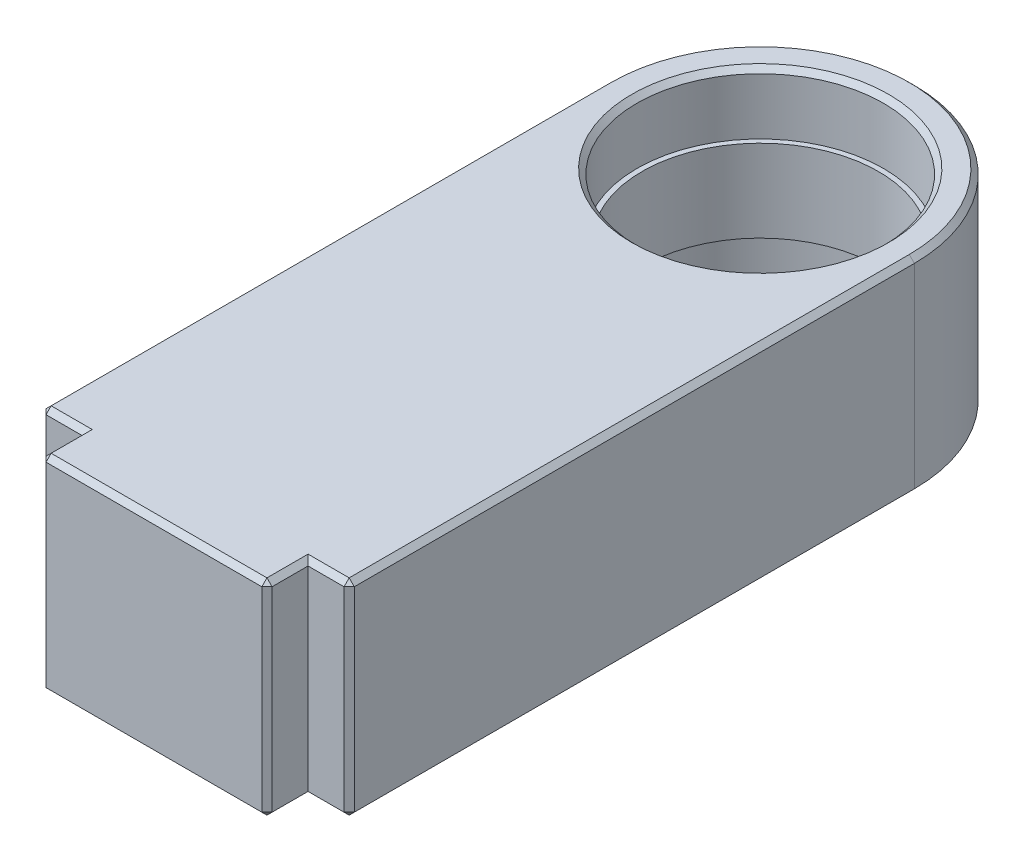
ISO-10303-21;
HEADER;
FILE_DESCRIPTION(('STEP AP214'),'2;1');
FILE_NAME('part.step','',(''),(''),'','','');
FILE_SCHEMA(('AUTOMOTIVE_DESIGN { 1 0 10303 214 1 1 1 1 }'));
ENDSEC;
DATA;
#1=APPLICATION_CONTEXT('core data for automotive mechanical design processes');
#2=APPLICATION_PROTOCOL_DEFINITION('international standard','automotive_design',2000,#1);
#3=PRODUCT_CONTEXT('',#1,'mechanical');
#4=PRODUCT('Part','Part','',(#3));
#5=PRODUCT_RELATED_PRODUCT_CATEGORY('part','',(#4));
#6=PRODUCT_DEFINITION_FORMATION('','',#4);
#7=PRODUCT_DEFINITION_CONTEXT('part definition',#1,'design');
#8=PRODUCT_DEFINITION('design','',#6,#7);
#9=PRODUCT_DEFINITION_SHAPE('','',#8);
#10=(LENGTH_UNIT() NAMED_UNIT(*) SI_UNIT(.MILLI.,.METRE.));
#11=(NAMED_UNIT(*) PLANE_ANGLE_UNIT() SI_UNIT($,.RADIAN.));
#12=(NAMED_UNIT(*) SI_UNIT($,.STERADIAN.) SOLID_ANGLE_UNIT());
#13=UNCERTAINTY_MEASURE_WITH_UNIT(LENGTH_MEASURE(1.E-05),#10,'distance_accuracy_value','');
#14=(GEOMETRIC_REPRESENTATION_CONTEXT(3) GLOBAL_UNCERTAINTY_ASSIGNED_CONTEXT((#13)) GLOBAL_UNIT_ASSIGNED_CONTEXT((#10,
#11,#12)) REPRESENTATION_CONTEXT('',''));
#15=CARTESIAN_POINT('',(0.,0.,0.));
#16=DIRECTION('',(0.,0.,1.));
#17=DIRECTION('',(1.,0.,0.));
#18=AXIS2_PLACEMENT_3D('',#15,#16,#17);
#19=CARTESIAN_POINT('',(15.,10.,55.));
#20=DIRECTION('',(0.,0.,-1.));
#21=DIRECTION('',(-1.,0.,0.));
#22=AXIS2_PLACEMENT_3D('',#19,#20,#21);
#23=PLANE('',#22);
#24=DIRECTION('',(0.,-1.,0.));
#25=VECTOR('',#24,1.);
#26=CARTESIAN_POINT('',(-11.,-10.,55.));
#27=LINE('',#26,#25);
#28=CARTESIAN_POINT('',(-11.,9.50000000000001,55.));
#29=VERTEX_POINT('',#28);
#30=CARTESIAN_POINT('',(-11.,-9.50000000000001,55.));
#31=VERTEX_POINT('',#30);
#32=EDGE_CURVE('E362',#29,#31,#27,.T.);
#33=ORIENTED_EDGE('',*,*,#32,.F.);
#34=DIRECTION('',(-1.,0.,0.));
#35=VECTOR('',#34,1.);
#36=CARTESIAN_POINT('',(-15.,9.50000000000001,55.));
#37=LINE('',#36,#35);
#38=CARTESIAN_POINT('',(-14.5,9.50000000000001,55.));
#39=VERTEX_POINT('',#38);
#40=EDGE_CURVE('E266',#29,#39,#37,.T.);
#41=ORIENTED_EDGE('',*,*,#40,.T.);
#42=DIRECTION('',(0.,-1.,0.));
#43=VECTOR('',#42,1.);
#44=CARTESIAN_POINT('',(-14.5,10.,55.));
#45=LINE('',#44,#43);
#46=CARTESIAN_POINT('',(-14.5,-9.50000000000001,55.));
#47=VERTEX_POINT('',#46);
#48=EDGE_CURVE('E264',#39,#47,#45,.T.);
#49=ORIENTED_EDGE('',*,*,#48,.T.);
#50=DIRECTION('',(1.,0.,0.));
#51=VECTOR('',#50,1.);
#52=CARTESIAN_POINT('',(15.,-9.50000000000001,55.));
#53=LINE('',#52,#51);
#54=EDGE_CURVE('E262',#47,#31,#53,.T.);
#55=ORIENTED_EDGE('',*,*,#54,.T.);
#56=EDGE_LOOP('',(#33,#41,#49,#55));
#57=FACE_BOUND('',#56,.T.);
#58=ADVANCED_FACE('F33',(#57),#23,.F.);
#59=DIRECTION('',(0.,1.,0.));
#60=VECTOR('',#59,1.);
#61=CARTESIAN_POINT('',(14.5,10.,55.));
#62=LINE('',#61,#60);
#63=CARTESIAN_POINT('',(14.5,-9.50000000000001,55.));
#64=VERTEX_POINT('',#63);
#65=CARTESIAN_POINT('',(14.5,9.50000000000001,55.));
#66=VERTEX_POINT('',#65);
#67=EDGE_CURVE('E237',#64,#66,#62,.T.);
#68=ORIENTED_EDGE('',*,*,#67,.T.);
#69=DIRECTION('',(-1.,0.,0.));
#70=VECTOR('',#69,1.);
#71=CARTESIAN_POINT('',(11.,9.50000000000001,55.));
#72=LINE('',#71,#70);
#73=CARTESIAN_POINT('',(11.,9.50000000000001,55.));
#74=VERTEX_POINT('',#73);
#75=EDGE_CURVE('E176',#66,#74,#72,.T.);
#76=ORIENTED_EDGE('',*,*,#75,.T.);
#77=DIRECTION('',(0.,1.,0.));
#78=VECTOR('',#77,1.);
#79=CARTESIAN_POINT('',(11.,-10.,55.));
#80=LINE('',#79,#78);
#81=CARTESIAN_POINT('',(11.,-9.50000000000001,55.));
#82=VERTEX_POINT('',#81);
#83=EDGE_CURVE('E368',#82,#74,#80,.T.);
#84=ORIENTED_EDGE('',*,*,#83,.F.);
#85=DIRECTION('',(1.,0.,0.));
#86=VECTOR('',#85,1.);
#87=CARTESIAN_POINT('',(15.,-9.50000000000001,55.));
#88=LINE('',#87,#86);
#89=EDGE_CURVE('E235',#82,#64,#88,.T.);
#90=ORIENTED_EDGE('',*,*,#89,.T.);
#91=EDGE_LOOP('',(#68,#76,#84,#90));
#92=FACE_BOUND('',#91,.T.);
#93=ADVANCED_FACE('F419',(#92),#23,.F.);
#94=CARTESIAN_POINT('',(0.,10.,0.));
#95=DIRECTION('',(0.,-1.,0.));
#96=DIRECTION('',(0.,0.,-1.));
#97=AXIS2_PLACEMENT_3D('',#94,#95,#96);
#98=CYLINDRICAL_SURFACE('',#97,12.);
#99=CARTESIAN_POINT('',(0.,-9.50000000000001,0.));
#100=DIRECTION('',(0.,1.,0.));
#101=DIRECTION('',(0.,0.,1.));
#102=AXIS2_PLACEMENT_3D('',#99,#100,#101);
#103=CIRCLE('',#102,12.);
#104=CARTESIAN_POINT('',(0.,-9.50000000000001,12.));
#105=VERTEX_POINT('',#104);
#106=EDGE_CURVE('E232',#105,#105,#103,.F.);
#107=ORIENTED_EDGE('',*,*,#106,.T.);
#108=EDGE_LOOP('',(#107));
#109=FACE_BOUND('',#108,.T.);
#110=CARTESIAN_POINT('',(0.,-4.,0.));
#111=DIRECTION('',(0.,1.,0.));
#112=DIRECTION('',(0.,0.,1.));
#113=AXIS2_PLACEMENT_3D('',#110,#111,#112);
#114=CIRCLE('',#113,12.);
#115=CARTESIAN_POINT('',(0.,-4.,12.));
#116=VERTEX_POINT('',#115);
#117=EDGE_CURVE('E379',#116,#116,#114,.T.);
#118=ORIENTED_EDGE('',*,*,#117,.T.);
#119=EDGE_LOOP('',(#118));
#120=FACE_BOUND('',#119,.T.);
#121=ADVANCED_FACE('F497',(#109,#120),#98,.F.);
#122=CARTESIAN_POINT('',(0.,10.,0.));
#123=DIRECTION('',(0.,1.,0.));
#124=DIRECTION('',(0.,0.,1.));
#125=AXIS2_PLACEMENT_3D('',#122,#123,#124);
#126=PLANE('',#125);
#127=CARTESIAN_POINT('',(0.,10.,0.));
#128=DIRECTION('',(0.,1.,0.));
#129=DIRECTION('',(0.,0.,1.));
#130=AXIS2_PLACEMENT_3D('',#127,#128,#129);
#131=CIRCLE('',#130,12.5);
#132=CARTESIAN_POINT('',(0.,10.,12.5));
#133=VERTEX_POINT('',#132);
#134=EDGE_CURVE('E204',#133,#133,#131,.F.);
#135=ORIENTED_EDGE('',*,*,#134,.T.);
#136=EDGE_LOOP('',(#135));
#137=FACE_BOUND('',#136,.T.);
#138=DIRECTION('',(0.,0.,-1.));
#139=VECTOR('',#138,1.);
#140=CARTESIAN_POINT('',(10.5,10.,55.));
#141=LINE('',#140,#139);
#142=CARTESIAN_POINT('',(10.5,10.,58.5));
#143=VERTEX_POINT('',#142);
#144=CARTESIAN_POINT('',(10.5,10.,54.5));
#145=VERTEX_POINT('',#144);
#146=EDGE_CURVE('E202',#143,#145,#141,.T.);
#147=ORIENTED_EDGE('',*,*,#146,.T.);
#148=DIRECTION('',(1.,0.,0.));
#149=VECTOR('',#148,1.);
#150=CARTESIAN_POINT('',(15.,10.,54.5));
#151=LINE('',#150,#149);
#152=CARTESIAN_POINT('',(14.5,10.,54.5));
#153=VERTEX_POINT('',#152);
#154=EDGE_CURVE('E174',#145,#153,#151,.T.);
#155=ORIENTED_EDGE('',*,*,#154,.T.);
#156=DIRECTION('',(0.,0.,-1.));
#157=VECTOR('',#156,1.);
#158=CARTESIAN_POINT('',(14.5,10.,0.));
#159=LINE('',#158,#157);
#160=CARTESIAN_POINT('',(14.5,10.,0.));
#161=VERTEX_POINT('',#160);
#162=EDGE_CURVE('E191',#153,#161,#159,.T.);
#163=ORIENTED_EDGE('',*,*,#162,.T.);
#164=CARTESIAN_POINT('',(0.,10.,0.));
#165=DIRECTION('',(0.,1.,0.));
#166=DIRECTION('',(0.,0.,1.));
#167=AXIS2_PLACEMENT_3D('',#164,#165,#166);
#168=CIRCLE('',#167,14.5);
#169=CARTESIAN_POINT('',(-14.5,10.,0.));
#170=VERTEX_POINT('',#169);
#171=EDGE_CURVE('E197',#161,#170,#168,.T.);
#172=ORIENTED_EDGE('',*,*,#171,.T.);
#173=DIRECTION('',(0.,0.,1.));
#174=VECTOR('',#173,1.);
#175=CARTESIAN_POINT('',(-14.5,10.,55.));
#176=LINE('',#175,#174);
#177=CARTESIAN_POINT('',(-14.5,10.,54.5));
#178=VERTEX_POINT('',#177);
#179=EDGE_CURVE('E396',#170,#178,#176,.T.);
#180=ORIENTED_EDGE('',*,*,#179,.T.);
#181=DIRECTION('',(1.,0.,0.));
#182=VECTOR('',#181,1.);
#183=CARTESIAN_POINT('',(-11.,10.,54.5));
#184=LINE('',#183,#182);
#185=CARTESIAN_POINT('',(-10.5,10.,54.5));
#186=VERTEX_POINT('',#185);
#187=EDGE_CURVE('E398',#178,#186,#184,.T.);
#188=ORIENTED_EDGE('',*,*,#187,.T.);
#189=DIRECTION('',(0.,0.,1.));
#190=VECTOR('',#189,1.);
#191=CARTESIAN_POINT('',(-10.5,10.,59.));
#192=LINE('',#191,#190);
#193=CARTESIAN_POINT('',(-10.5,10.,58.5));
#194=VERTEX_POINT('',#193);
#195=EDGE_CURVE('E400',#186,#194,#192,.T.);
#196=ORIENTED_EDGE('',*,*,#195,.T.);
#197=DIRECTION('',(1.,0.,0.));
#198=VECTOR('',#197,1.);
#199=CARTESIAN_POINT('',(0.,10.,58.5));
#200=LINE('',#199,#198);
#201=EDGE_CURVE('E209',#194,#143,#200,.T.);
#202=ORIENTED_EDGE('',*,*,#201,.T.);
#203=EDGE_LOOP('',(#147,#155,#163,#172,#180,#188,#196,#202));
#204=FACE_BOUND('',#203,.T.);
#205=ADVANCED_FACE('F200',(#137,#204),#126,.T.);
#206=CARTESIAN_POINT('',(0.,-10.,0.));
#207=DIRECTION('',(0.,1.,0.));
#208=DIRECTION('',(0.,0.,1.));
#209=AXIS2_PLACEMENT_3D('',#206,#207,#208);
#210=PLANE('',#209);
#211=CARTESIAN_POINT('',(0.,-10.,0.));
#212=DIRECTION('',(0.,1.,0.));
#213=DIRECTION('',(0.,0.,1.));
#214=AXIS2_PLACEMENT_3D('',#211,#212,#213);
#215=CIRCLE('',#214,12.5);
#216=CARTESIAN_POINT('',(0.,-10.,12.5));
#217=VERTEX_POINT('',#216);
#218=EDGE_CURVE('E229',#217,#217,#215,.T.);
#219=ORIENTED_EDGE('',*,*,#218,.T.);
#220=EDGE_LOOP('',(#219));
#221=FACE_BOUND('',#220,.T.);
#222=DIRECTION('',(0.,0.,-1.));
#223=VECTOR('',#222,1.);
#224=CARTESIAN_POINT('',(-14.5,-10.,0.));
#225=LINE('',#224,#223);
#226=CARTESIAN_POINT('',(-14.5,-10.,54.5));
#227=VERTEX_POINT('',#226);
#228=CARTESIAN_POINT('',(-14.5,-10.,0.));
#229=VERTEX_POINT('',#228);
#230=EDGE_CURVE('E224',#227,#229,#225,.T.);
#231=ORIENTED_EDGE('',*,*,#230,.T.);
#232=CARTESIAN_POINT('',(0.,-10.,0.));
#233=DIRECTION('',(0.,1.,0.));
#234=DIRECTION('',(0.,0.,1.));
#235=AXIS2_PLACEMENT_3D('',#232,#233,#234);
#236=CIRCLE('',#235,14.5);
#237=CARTESIAN_POINT('',(14.5,-10.,0.));
#238=VERTEX_POINT('',#237);
#239=EDGE_CURVE('E226',#229,#238,#236,.F.);
#240=ORIENTED_EDGE('',*,*,#239,.T.);
#241=DIRECTION('',(0.,0.,1.));
#242=VECTOR('',#241,1.);
#243=CARTESIAN_POINT('',(14.5,-10.,0.));
#244=LINE('',#243,#242);
#245=CARTESIAN_POINT('',(14.5,-10.,54.5));
#246=VERTEX_POINT('',#245);
#247=EDGE_CURVE('E218',#238,#246,#244,.T.);
#248=ORIENTED_EDGE('',*,*,#247,.T.);
#249=DIRECTION('',(-1.,0.,0.));
#250=VECTOR('',#249,1.);
#251=CARTESIAN_POINT('',(0.,-10.,54.5));
#252=LINE('',#251,#250);
#253=CARTESIAN_POINT('',(10.5,-10.,54.5));
#254=VERTEX_POINT('',#253);
#255=EDGE_CURVE('E216',#246,#254,#252,.T.);
#256=ORIENTED_EDGE('',*,*,#255,.T.);
#257=DIRECTION('',(0.,0.,1.));
#258=VECTOR('',#257,1.);
#259=CARTESIAN_POINT('',(10.5,-10.,0.));
#260=LINE('',#259,#258);
#261=CARTESIAN_POINT('',(10.5,-10.,58.5));
#262=VERTEX_POINT('',#261);
#263=EDGE_CURVE('E214',#254,#262,#260,.T.);
#264=ORIENTED_EDGE('',*,*,#263,.T.);
#265=DIRECTION('',(-1.,0.,0.));
#266=VECTOR('',#265,1.);
#267=CARTESIAN_POINT('',(-11.,-10.,58.5));
#268=LINE('',#267,#266);
#269=CARTESIAN_POINT('',(-10.5,-10.,58.5));
#270=VERTEX_POINT('',#269);
#271=EDGE_CURVE('E207',#262,#270,#268,.T.);
#272=ORIENTED_EDGE('',*,*,#271,.T.);
#273=DIRECTION('',(0.,0.,-1.));
#274=VECTOR('',#273,1.);
#275=CARTESIAN_POINT('',(-10.5,-10.,0.));
#276=LINE('',#275,#274);
#277=CARTESIAN_POINT('',(-10.5,-10.,54.5));
#278=VERTEX_POINT('',#277);
#279=EDGE_CURVE('E220',#270,#278,#276,.T.);
#280=ORIENTED_EDGE('',*,*,#279,.T.);
#281=DIRECTION('',(-1.,0.,0.));
#282=VECTOR('',#281,1.);
#283=CARTESIAN_POINT('',(0.,-10.,54.5));
#284=LINE('',#283,#282);
#285=EDGE_CURVE('E222',#278,#227,#284,.T.);
#286=ORIENTED_EDGE('',*,*,#285,.T.);
#287=EDGE_LOOP('',(#231,#240,#248,#256,#264,#272,#280,#286));
#288=FACE_BOUND('',#287,.T.);
#289=ADVANCED_FACE('F445',(#221,#288),#210,.F.);
#290=CARTESIAN_POINT('',(15.,10.,55.));
#291=DIRECTION('',(-1.,0.,0.));
#292=DIRECTION('',(0.,0.,1.));
#293=AXIS2_PLACEMENT_3D('',#290,#291,#292);
#294=PLANE('',#293);
#295=DIRECTION('',(0.,-1.,0.));
#296=VECTOR('',#295,1.);
#297=CARTESIAN_POINT('',(15.,10.,0.));
#298=LINE('',#297,#296);
#299=CARTESIAN_POINT('',(15.,9.50000000000001,0.));
#300=VERTEX_POINT('',#299);
#301=CARTESIAN_POINT('',(15.,-9.50000000000001,0.));
#302=VERTEX_POINT('',#301);
#303=EDGE_CURVE('E387',#300,#302,#298,.T.);
#304=ORIENTED_EDGE('',*,*,#303,.F.);
#305=DIRECTION('',(0.,0.,1.));
#306=VECTOR('',#305,1.);
#307=CARTESIAN_POINT('',(15.,9.50000000000001,55.));
#308=LINE('',#307,#306);
#309=CARTESIAN_POINT('',(15.,9.50000000000001,54.5));
#310=VERTEX_POINT('',#309);
#311=EDGE_CURVE('E11',#300,#310,#308,.T.);
#312=ORIENTED_EDGE('',*,*,#311,.T.);
#313=DIRECTION('',(0.,-1.,0.));
#314=VECTOR('',#313,1.);
#315=CARTESIAN_POINT('',(15.,10.,54.5));
#316=LINE('',#315,#314);
#317=CARTESIAN_POINT('',(15.,-9.50000000000001,54.5));
#318=VERTEX_POINT('',#317);
#319=EDGE_CURVE('E49',#310,#318,#316,.T.);
#320=ORIENTED_EDGE('',*,*,#319,.T.);
#321=DIRECTION('',(0.,0.,-1.));
#322=VECTOR('',#321,1.);
#323=CARTESIAN_POINT('',(15.,-9.50000000000001,55.));
#324=LINE('',#323,#322);
#325=EDGE_CURVE('E42',#318,#302,#324,.T.);
#326=ORIENTED_EDGE('',*,*,#325,.T.);
#327=EDGE_LOOP('',(#304,#312,#320,#326));
#328=FACE_BOUND('',#327,.T.);
#329=ADVANCED_FACE('F509',(#328),#294,.F.);
#330=CARTESIAN_POINT('',(0.,10.,0.));
#331=DIRECTION('',(0.,-1.,0.));
#332=DIRECTION('',(0.,0.,-1.));
#333=AXIS2_PLACEMENT_3D('',#330,#331,#332);
#334=CYLINDRICAL_SURFACE('',#333,15.);
#335=DIRECTION('',(0.,-1.,0.));
#336=VECTOR('',#335,1.);
#337=CARTESIAN_POINT('',(-15.,10.,0.));
#338=LINE('',#337,#336);
#339=CARTESIAN_POINT('',(-15.,9.50000000000001,0.));
#340=VERTEX_POINT('',#339);
#341=CARTESIAN_POINT('',(-15.,-9.50000000000001,0.));
#342=VERTEX_POINT('',#341);
#343=EDGE_CURVE('E384',#340,#342,#338,.T.);
#344=ORIENTED_EDGE('',*,*,#343,.F.);
#345=CARTESIAN_POINT('',(0.,9.50000000000001,0.));
#346=DIRECTION('',(0.,1.,0.));
#347=DIRECTION('',(0.,0.,1.));
#348=AXIS2_PLACEMENT_3D('',#345,#346,#347);
#349=CIRCLE('',#348,15.);
#350=EDGE_CURVE('E277',#340,#300,#349,.F.);
#351=ORIENTED_EDGE('',*,*,#350,.T.);
#352=ORIENTED_EDGE('',*,*,#303,.T.);
#353=CARTESIAN_POINT('',(0.,-9.50000000000001,0.));
#354=DIRECTION('',(0.,1.,0.));
#355=DIRECTION('',(0.,0.,1.));
#356=AXIS2_PLACEMENT_3D('',#353,#354,#355);
#357=CIRCLE('',#356,15.);
#358=EDGE_CURVE('E275',#302,#342,#357,.T.);
#359=ORIENTED_EDGE('',*,*,#358,.T.);
#360=EDGE_LOOP('',(#344,#351,#352,#359));
#361=FACE_BOUND('',#360,.T.);
#362=ADVANCED_FACE('F505',(#361),#334,.T.);
#363=CARTESIAN_POINT('',(-15.,10.,55.));
#364=DIRECTION('',(1.,0.,0.));
#365=DIRECTION('',(0.,0.,-1.));
#366=AXIS2_PLACEMENT_3D('',#363,#364,#365);
#367=PLANE('',#366);
#368=DIRECTION('',(0.,1.,0.));
#369=VECTOR('',#368,1.);
#370=CARTESIAN_POINT('',(-15.,10.,54.5));
#371=LINE('',#370,#369);
#372=CARTESIAN_POINT('',(-15.,-9.50000000000001,54.5));
#373=VERTEX_POINT('',#372);
#374=CARTESIAN_POINT('',(-15.,9.50000000000001,54.5));
#375=VERTEX_POINT('',#374);
#376=EDGE_CURVE('E268',#373,#375,#371,.T.);
#377=ORIENTED_EDGE('',*,*,#376,.T.);
#378=DIRECTION('',(0.,0.,-1.));
#379=VECTOR('',#378,1.);
#380=CARTESIAN_POINT('',(-15.,9.50000000000001,0.));
#381=LINE('',#380,#379);
#382=EDGE_CURVE('E272',#375,#340,#381,.T.);
#383=ORIENTED_EDGE('',*,*,#382,.T.);
#384=ORIENTED_EDGE('',*,*,#343,.T.);
#385=DIRECTION('',(0.,0.,1.));
#386=VECTOR('',#385,1.);
#387=CARTESIAN_POINT('',(-15.,-9.50000000000001,55.));
#388=LINE('',#387,#386);
#389=EDGE_CURVE('E270',#342,#373,#388,.T.);
#390=ORIENTED_EDGE('',*,*,#389,.T.);
#391=EDGE_LOOP('',(#377,#383,#384,#390));
#392=FACE_BOUND('',#391,.T.);
#393=ADVANCED_FACE('F501',(#392),#367,.F.);
#394=CARTESIAN_POINT('',(0.,9.49999999999999,0.));
#395=DIRECTION('',(0.,1.,0.));
#396=DIRECTION('',(0.,0.,1.));
#397=AXIS2_PLACEMENT_3D('',#394,#395,#396);
#398=CIRCLE('',#397,12.);
#399=CARTESIAN_POINT('',(0.,9.49999999999999,12.));
#400=VERTEX_POINT('',#399);
#401=EDGE_CURVE('E198',#400,#400,#398,.T.);
#402=ORIENTED_EDGE('',*,*,#401,.T.);
#403=EDGE_LOOP('',(#402));
#404=FACE_BOUND('',#403,.T.);
#405=CARTESIAN_POINT('',(0.,4.,0.));
#406=DIRECTION('',(0.,1.,0.));
#407=DIRECTION('',(0.,0.,1.));
#408=AXIS2_PLACEMENT_3D('',#405,#406,#407);
#409=CIRCLE('',#408,12.);
#410=CARTESIAN_POINT('',(0.,4.,12.));
#411=VERTEX_POINT('',#410);
#412=EDGE_CURVE('E390',#411,#411,#409,.T.);
#413=ORIENTED_EDGE('',*,*,#412,.F.);
#414=EDGE_LOOP('',(#413));
#415=FACE_BOUND('',#414,.T.);
#416=ADVANCED_FACE('F504',(#404,#415),#98,.F.);
#417=CARTESIAN_POINT('',(0.,4.,0.));
#418=DIRECTION('',(0.,1.,0.));
#419=DIRECTION('',(0.,0.,1.));
#420=AXIS2_PLACEMENT_3D('',#417,#418,#419);
#421=PLANE('',#420);
#422=ORIENTED_EDGE('',*,*,#412,.T.);
#423=EDGE_LOOP('',(#422));
#424=FACE_BOUND('',#423,.T.);
#425=CARTESIAN_POINT('',(0.,4.,0.));
#426=DIRECTION('',(0.,1.,0.));
#427=DIRECTION('',(0.,0.,1.));
#428=AXIS2_PLACEMENT_3D('',#425,#426,#427);
#429=CIRCLE('',#428,11.5);
#430=CARTESIAN_POINT('',(0.,4.,11.5));
#431=VERTEX_POINT('',#430);
#432=EDGE_CURVE('E376',#431,#431,#429,.T.);
#433=ORIENTED_EDGE('',*,*,#432,.F.);
#434=EDGE_LOOP('',(#433));
#435=FACE_BOUND('',#434,.T.);
#436=ADVANCED_FACE('F831',(#424,#435),#421,.T.);
#437=CARTESIAN_POINT('',(0.,-4.,0.));
#438=DIRECTION('',(0.,1.,0.));
#439=DIRECTION('',(0.,0.,1.));
#440=AXIS2_PLACEMENT_3D('',#437,#438,#439);
#441=PLANE('',#440);
#442=ORIENTED_EDGE('',*,*,#117,.F.);
#443=EDGE_LOOP('',(#442));
#444=FACE_BOUND('',#443,.T.);
#445=CARTESIAN_POINT('',(0.,-4.,0.));
#446=DIRECTION('',(0.,1.,0.));
#447=DIRECTION('',(0.,0.,1.));
#448=AXIS2_PLACEMENT_3D('',#445,#446,#447);
#449=CIRCLE('',#448,11.5);
#450=CARTESIAN_POINT('',(0.,-4.,11.5));
#451=VERTEX_POINT('',#450);
#452=EDGE_CURVE('E373',#451,#451,#449,.T.);
#453=ORIENTED_EDGE('',*,*,#452,.T.);
#454=EDGE_LOOP('',(#453));
#455=FACE_BOUND('',#454,.T.);
#456=ADVANCED_FACE('F822',(#444,#455),#441,.F.);
#457=CARTESIAN_POINT('',(0.,4.,0.));
#458=DIRECTION('',(0.,-1.,0.));
#459=DIRECTION('',(0.,0.,-1.));
#460=AXIS2_PLACEMENT_3D('',#457,#458,#459);
#461=CYLINDRICAL_SURFACE('',#460,11.5);
#462=ORIENTED_EDGE('',*,*,#432,.T.);
#463=EDGE_LOOP('',(#462));
#464=FACE_BOUND('',#463,.T.);
#465=ORIENTED_EDGE('',*,*,#452,.F.);
#466=EDGE_LOOP('',(#465));
#467=FACE_BOUND('',#466,.T.);
#468=ADVANCED_FACE('F781',(#464,#467),#461,.F.);
#469=CARTESIAN_POINT('',(-11.,-10.,59.));
#470=DIRECTION('',(1.,0.,0.));
#471=DIRECTION('',(0.,0.,-1.));
#472=AXIS2_PLACEMENT_3D('',#469,#470,#471);
#473=PLANE('',#472);
#474=DIRECTION('',(0.,1.,0.));
#475=VECTOR('',#474,1.);
#476=CARTESIAN_POINT('',(-11.,10.,58.5));
#477=LINE('',#476,#475);
#478=CARTESIAN_POINT('',(-11.,-9.50000000000001,58.5));
#479=VERTEX_POINT('',#478);
#480=CARTESIAN_POINT('',(-11.,9.50000000000001,58.5));
#481=VERTEX_POINT('',#480);
#482=EDGE_CURVE('E255',#479,#481,#477,.T.);
#483=ORIENTED_EDGE('',*,*,#482,.T.);
#484=DIRECTION('',(0.,0.,-1.));
#485=VECTOR('',#484,1.);
#486=CARTESIAN_POINT('',(-11.,9.50000000000001,55.));
#487=LINE('',#486,#485);
#488=EDGE_CURVE('E259',#481,#29,#487,.T.);
#489=ORIENTED_EDGE('',*,*,#488,.T.);
#490=ORIENTED_EDGE('',*,*,#32,.T.);
#491=DIRECTION('',(0.,0.,1.));
#492=VECTOR('',#491,1.);
#493=CARTESIAN_POINT('',(-11.,-9.50000000000001,59.));
#494=LINE('',#493,#492);
#495=EDGE_CURVE('E257',#31,#479,#494,.T.);
#496=ORIENTED_EDGE('',*,*,#495,.T.);
#497=EDGE_LOOP('',(#483,#489,#490,#496));
#498=FACE_BOUND('',#497,.T.);
#499=ADVANCED_FACE('F457',(#498),#473,.F.);
#500=CARTESIAN_POINT('',(11.,-10.,59.));
#501=DIRECTION('',(-1.,0.,0.));
#502=DIRECTION('',(0.,0.,1.));
#503=AXIS2_PLACEMENT_3D('',#500,#501,#502);
#504=PLANE('',#503);
#505=ORIENTED_EDGE('',*,*,#83,.T.);
#506=DIRECTION('',(0.,0.,1.));
#507=VECTOR('',#506,1.);
#508=CARTESIAN_POINT('',(11.,9.50000000000001,59.));
#509=LINE('',#508,#507);
#510=CARTESIAN_POINT('',(11.,9.50000000000001,58.5));
#511=VERTEX_POINT('',#510);
#512=EDGE_CURVE('E244',#74,#511,#509,.T.);
#513=ORIENTED_EDGE('',*,*,#512,.T.);
#514=DIRECTION('',(0.,-1.,0.));
#515=VECTOR('',#514,1.);
#516=CARTESIAN_POINT('',(11.,-10.,58.5));
#517=LINE('',#516,#515);
#518=CARTESIAN_POINT('',(11.,-9.50000000000001,58.5));
#519=VERTEX_POINT('',#518);
#520=EDGE_CURVE('E240',#511,#519,#517,.T.);
#521=ORIENTED_EDGE('',*,*,#520,.T.);
#522=DIRECTION('',(0.,0.,-1.));
#523=VECTOR('',#522,1.);
#524=CARTESIAN_POINT('',(11.,-9.50000000000001,59.));
#525=LINE('',#524,#523);
#526=EDGE_CURVE('E242',#519,#82,#525,.T.);
#527=ORIENTED_EDGE('',*,*,#526,.T.);
#528=EDGE_LOOP('',(#505,#513,#521,#527));
#529=FACE_BOUND('',#528,.T.);
#530=ADVANCED_FACE('F422',(#529),#504,.F.);
#531=CARTESIAN_POINT('',(0.,0.,59.));
#532=DIRECTION('',(0.,0.,1.));
#533=DIRECTION('',(1.,0.,0.));
#534=AXIS2_PLACEMENT_3D('',#531,#532,#533);
#535=PLANE('',#534);
#536=DIRECTION('',(0.,1.,0.));
#537=VECTOR('',#536,1.);
#538=CARTESIAN_POINT('',(10.5,10.,59.));
#539=LINE('',#538,#537);
#540=CARTESIAN_POINT('',(10.5,-9.50000000000001,59.));
#541=VERTEX_POINT('',#540);
#542=CARTESIAN_POINT('',(10.5,9.50000000000001,59.));
#543=VERTEX_POINT('',#542);
#544=EDGE_CURVE('E250',#541,#543,#539,.T.);
#545=ORIENTED_EDGE('',*,*,#544,.T.);
#546=DIRECTION('',(-1.,0.,0.));
#547=VECTOR('',#546,1.);
#548=CARTESIAN_POINT('',(0.,9.50000000000001,59.));
#549=LINE('',#548,#547);
#550=CARTESIAN_POINT('',(-10.5,9.50000000000001,59.));
#551=VERTEX_POINT('',#550);
#552=EDGE_CURVE('E252',#543,#551,#549,.T.);
#553=ORIENTED_EDGE('',*,*,#552,.T.);
#554=DIRECTION('',(0.,-1.,0.));
#555=VECTOR('',#554,1.);
#556=CARTESIAN_POINT('',(-10.5,-10.,59.));
#557=LINE('',#556,#555);
#558=CARTESIAN_POINT('',(-10.5,-9.50000000000001,59.));
#559=VERTEX_POINT('',#558);
#560=EDGE_CURVE('E246',#551,#559,#557,.T.);
#561=ORIENTED_EDGE('',*,*,#560,.T.);
#562=DIRECTION('',(1.,0.,0.));
#563=VECTOR('',#562,1.);
#564=CARTESIAN_POINT('',(11.,-9.50000000000001,59.));
#565=LINE('',#564,#563);
#566=EDGE_CURVE('E248',#559,#541,#565,.T.);
#567=ORIENTED_EDGE('',*,*,#566,.T.);
#568=EDGE_LOOP('',(#545,#553,#561,#567));
#569=FACE_BOUND('',#568,.T.);
#570=ADVANCED_FACE('F437',(#569),#535,.T.);
#571=CARTESIAN_POINT('',(0.,9.49999999999999,0.));
#572=DIRECTION('',(0.,1.,0.));
#573=DIRECTION('',(0.,0.,1.));
#574=AXIS2_PLACEMENT_3D('',#571,#572,#573);
#575=CONICAL_SURFACE('',#574,12.,0.785398163397455);
#576=ORIENTED_EDGE('',*,*,#134,.F.);
#577=EDGE_LOOP('',(#576));
#578=FACE_BOUND('',#577,.T.);
#579=ORIENTED_EDGE('',*,*,#401,.F.);
#580=EDGE_LOOP('',(#579));
#581=FACE_BOUND('',#580,.T.);
#582=ADVANCED_FACE('F489',(#578,#581),#575,.F.);
#583=CARTESIAN_POINT('',(0.,-10.,0.));
#584=DIRECTION('',(0.,-1.,0.));
#585=DIRECTION('',(0.,0.,-1.));
#586=AXIS2_PLACEMENT_3D('',#583,#584,#585);
#587=CONICAL_SURFACE('',#586,12.5,0.78539816339745);
#588=ORIENTED_EDGE('',*,*,#106,.F.);
#589=EDGE_LOOP('',(#588));
#590=FACE_BOUND('',#589,.T.);
#591=ORIENTED_EDGE('',*,*,#218,.F.);
#592=EDGE_LOOP('',(#591));
#593=FACE_BOUND('',#592,.T.);
#594=ADVANCED_FACE('F484',(#590,#593),#587,.F.);
#595=CARTESIAN_POINT('',(15.,-9.50000000000001,55.));
#596=DIRECTION('',(0.,0.707106781186545,-0.70710678118655));
#597=DIRECTION('',(1.,0.,0.));
#598=AXIS2_PLACEMENT_3D('',#595,#596,#597);
#599=PLANE('',#598);
#600=DIRECTION('',(0.,-0.70710678118655,-0.707106781186545));
#601=VECTOR('',#600,1.);
#602=CARTESIAN_POINT('',(-14.5,-9.75000000000001,54.75));
#603=LINE('',#602,#601);
#604=EDGE_CURVE('E355',#227,#47,#603,.F.);
#605=ORIENTED_EDGE('',*,*,#604,.F.);
#606=ORIENTED_EDGE('',*,*,#285,.F.);
#607=DIRECTION('',(0.577350269189627,-0.577350269189627,-0.577350269189623));
#608=VECTOR('',#607,1.);
#609=CARTESIAN_POINT('',(-2.33333333333329,-18.1666666666667,46.3333333333333));
#610=LINE('',#609,#608);
#611=EDGE_CURVE('E37',#31,#278,#610,.T.);
#612=ORIENTED_EDGE('',*,*,#611,.F.);
#613=ORIENTED_EDGE('',*,*,#54,.F.);
#614=EDGE_LOOP('',(#605,#606,#612,#613));
#615=FACE_BOUND('',#614,.T.);
#616=ADVANCED_FACE('F35',(#615),#599,.F.);
#617=CARTESIAN_POINT('',(-10.5,-10.,0.));
#618=DIRECTION('',(0.707106781186548,0.707106781186548,0.));
#619=DIRECTION('',(0.,0.,-1.));
#620=AXIS2_PLACEMENT_3D('',#617,#618,#619);
#621=PLANE('',#620);
#622=ORIENTED_EDGE('',*,*,#611,.T.);
#623=ORIENTED_EDGE('',*,*,#279,.F.);
#624=DIRECTION('',(-0.707106781186547,0.707106781186547,0.));
#625=VECTOR('',#624,1.);
#626=CARTESIAN_POINT('',(-11.,-9.50000000000001,58.5));
#627=LINE('',#626,#625);
#628=EDGE_CURVE('E353',#479,#270,#627,.F.);
#629=ORIENTED_EDGE('',*,*,#628,.F.);
#630=ORIENTED_EDGE('',*,*,#495,.F.);
#631=EDGE_LOOP('',(#622,#623,#629,#630));
#632=FACE_BOUND('',#631,.T.);
#633=ADVANCED_FACE('F448',(#632),#621,.F.);
#634=CARTESIAN_POINT('',(-15.,-9.50000000000001,54.5));
#635=DIRECTION('',(-0.577350269189626,-0.577350269189626,0.577350269189626));
#636=DIRECTION('',(0.707106781186548,0.,0.707106781186548));
#637=AXIS2_PLACEMENT_3D('',#634,#635,#636);
#638=PLANE('',#637);
#639=DIRECTION('',(-0.707106781186547,0.707106781186547,0.));
#640=VECTOR('',#639,1.);
#641=CARTESIAN_POINT('',(-15.,-9.50000000000001,54.5));
#642=LINE('',#641,#640);
#643=EDGE_CURVE('E347',#227,#373,#642,.T.);
#644=ORIENTED_EDGE('',*,*,#643,.F.);
#645=ORIENTED_EDGE('',*,*,#604,.T.);
#646=DIRECTION('',(0.707106781186547,0.,0.707106781186547));
#647=VECTOR('',#646,1.);
#648=CARTESIAN_POINT('',(-15.,-9.50000000000001,54.5));
#649=LINE('',#648,#647);
#650=EDGE_CURVE('E350',#373,#47,#649,.T.);
#651=ORIENTED_EDGE('',*,*,#650,.F.);
#652=EDGE_LOOP('',(#644,#645,#651));
#653=FACE_BOUND('',#652,.T.);
#654=ADVANCED_FACE('F475',(#653),#638,.T.);
#655=CARTESIAN_POINT('',(-11.,-9.50000000000001,58.5));
#656=DIRECTION('',(-0.577350269189626,-0.577350269189626,0.577350269189626));
#657=DIRECTION('',(0.707106781186548,0.,0.707106781186548));
#658=AXIS2_PLACEMENT_3D('',#655,#656,#657);
#659=PLANE('',#658);
#660=DIRECTION('',(-0.707106781186547,0.,-0.707106781186547));
#661=VECTOR('',#660,1.);
#662=CARTESIAN_POINT('',(-11.,-9.50000000000001,58.5));
#663=LINE('',#662,#661);
#664=EDGE_CURVE('E341',#479,#559,#663,.F.);
#665=ORIENTED_EDGE('',*,*,#664,.F.);
#666=ORIENTED_EDGE('',*,*,#628,.T.);
#667=DIRECTION('',(0.,0.707106781186547,0.707106781186547));
#668=VECTOR('',#667,1.);
#669=CARTESIAN_POINT('',(-10.5,-9.75000000000001,58.75));
#670=LINE('',#669,#668);
#671=EDGE_CURVE('E344',#559,#270,#670,.F.);
#672=ORIENTED_EDGE('',*,*,#671,.F.);
#673=EDGE_LOOP('',(#665,#666,#672));
#674=FACE_BOUND('',#673,.T.);
#675=ADVANCED_FACE('F451',(#674),#659,.T.);
#676=CARTESIAN_POINT('',(0.,10.,54.5));
#677=DIRECTION('',(0.,0.707106781186545,0.70710678118655));
#678=DIRECTION('',(-1.,0.,0.));
#679=AXIS2_PLACEMENT_3D('',#676,#677,#678);
#680=PLANE('',#679);
#681=DIRECTION('',(0.,0.70710678118655,-0.707106781186545));
#682=VECTOR('',#681,1.);
#683=CARTESIAN_POINT('',(-14.5,9.50000000000001,55.));
#684=LINE('',#683,#682);
#685=EDGE_CURVE('E336',#39,#178,#684,.T.);
#686=ORIENTED_EDGE('',*,*,#685,.F.);
#687=ORIENTED_EDGE('',*,*,#40,.F.);
#688=DIRECTION('',(0.577350269189626,0.577350269189628,-0.577350269189624));
#689=VECTOR('',#688,1.);
#690=CARTESIAN_POINT('',(-12.3333333333333,8.16666666666668,56.3333333333333));
#691=LINE('',#690,#689);
#692=EDGE_CURVE('E339',#186,#29,#691,.F.);
#693=ORIENTED_EDGE('',*,*,#692,.F.);
#694=ORIENTED_EDGE('',*,*,#187,.F.);
#695=EDGE_LOOP('',(#686,#687,#693,#694));
#696=FACE_BOUND('',#695,.T.);
#697=ADVANCED_FACE('F466',(#696),#680,.T.);
#698=CARTESIAN_POINT('',(-14.5,10.,55.));
#699=DIRECTION('',(0.707106781186548,0.,-0.707106781186548));
#700=DIRECTION('',(0.,-1.,0.));
#701=AXIS2_PLACEMENT_3D('',#698,#699,#700);
#702=PLANE('',#701);
#703=ORIENTED_EDGE('',*,*,#650,.T.);
#704=ORIENTED_EDGE('',*,*,#48,.F.);
#705=DIRECTION('',(-0.707106781186547,0.,-0.707106781186547));
#706=VECTOR('',#705,1.);
#707=CARTESIAN_POINT('',(-14.5,9.50000000000001,55.));
#708=LINE('',#707,#706);
#709=EDGE_CURVE('E333',#375,#39,#708,.F.);
#710=ORIENTED_EDGE('',*,*,#709,.F.);
#711=ORIENTED_EDGE('',*,*,#376,.F.);
#712=EDGE_LOOP('',(#703,#704,#710,#711));
#713=FACE_BOUND('',#712,.T.);
#714=ADVANCED_FACE('F472',(#713),#702,.F.);
#715=CARTESIAN_POINT('',(-15.,-9.50000000000001,55.));
#716=DIRECTION('',(0.707106781186548,0.707106781186548,0.));
#717=DIRECTION('',(0.,0.,1.));
#718=AXIS2_PLACEMENT_3D('',#715,#716,#717);
#719=PLANE('',#718);
#720=ORIENTED_EDGE('',*,*,#643,.T.);
#721=ORIENTED_EDGE('',*,*,#389,.F.);
#722=DIRECTION('',(-0.707106781186548,0.707106781186548,0.));
#723=VECTOR('',#722,1.);
#724=CARTESIAN_POINT('',(-14.5,-10.,0.));
#725=LINE('',#724,#723);
#726=EDGE_CURVE('E330',#229,#342,#725,.T.);
#727=ORIENTED_EDGE('',*,*,#726,.F.);
#728=ORIENTED_EDGE('',*,*,#230,.F.);
#729=EDGE_LOOP('',(#720,#721,#727,#728));
#730=FACE_BOUND('',#729,.T.);
#731=ADVANCED_FACE('F480',(#730),#719,.F.);
#732=CARTESIAN_POINT('',(0.,-9.50000000000001,59.));
#733=DIRECTION('',(0.,-0.707106781186548,0.707106781186548));
#734=DIRECTION('',(-1.,0.,0.));
#735=AXIS2_PLACEMENT_3D('',#732,#733,#734);
#736=PLANE('',#735);
#737=ORIENTED_EDGE('',*,*,#671,.T.);
#738=ORIENTED_EDGE('',*,*,#271,.F.);
#739=DIRECTION('',(0.,-0.707106781186547,-0.707106781186547));
#740=VECTOR('',#739,1.);
#741=CARTESIAN_POINT('',(10.5,-10.,58.5));
#742=LINE('',#741,#740);
#743=EDGE_CURVE('E324',#541,#262,#742,.T.);
#744=ORIENTED_EDGE('',*,*,#743,.F.);
#745=ORIENTED_EDGE('',*,*,#566,.F.);
#746=EDGE_LOOP('',(#737,#738,#744,#745));
#747=FACE_BOUND('',#746,.T.);
#748=ADVANCED_FACE('F442',(#747),#736,.T.);
#749=CARTESIAN_POINT('',(-10.5,0.,59.));
#750=DIRECTION('',(-0.707106781186548,0.,0.707106781186548));
#751=DIRECTION('',(0.,1.,0.));
#752=AXIS2_PLACEMENT_3D('',#749,#750,#751);
#753=PLANE('',#752);
#754=ORIENTED_EDGE('',*,*,#664,.T.);
#755=ORIENTED_EDGE('',*,*,#560,.F.);
#756=DIRECTION('',(0.707106781186547,0.,0.707106781186547));
#757=VECTOR('',#756,1.);
#758=CARTESIAN_POINT('',(-10.5,9.50000000000001,59.));
#759=LINE('',#758,#757);
#760=EDGE_CURVE('E321',#481,#551,#759,.T.);
#761=ORIENTED_EDGE('',*,*,#760,.F.);
#762=ORIENTED_EDGE('',*,*,#482,.F.);
#763=EDGE_LOOP('',(#754,#755,#761,#762));
#764=FACE_BOUND('',#763,.T.);
#765=ADVANCED_FACE('F455',(#764),#753,.T.);
#766=CARTESIAN_POINT('',(-11.,9.50000000000001,59.));
#767=DIRECTION('',(-0.707106781186549,0.707106781186546,0.));
#768=DIRECTION('',(0.,0.,1.));
#769=AXIS2_PLACEMENT_3D('',#766,#767,#768);
#770=PLANE('',#769);
#771=ORIENTED_EDGE('',*,*,#692,.T.);
#772=ORIENTED_EDGE('',*,*,#488,.F.);
#773=DIRECTION('',(-0.707106781186546,-0.707106781186549,0.));
#774=VECTOR('',#773,1.);
#775=CARTESIAN_POINT('',(-10.75,9.75000000000001,58.5));
#776=LINE('',#775,#774);
#777=EDGE_CURVE('E318',#194,#481,#776,.T.);
#778=ORIENTED_EDGE('',*,*,#777,.F.);
#779=ORIENTED_EDGE('',*,*,#195,.F.);
#780=EDGE_LOOP('',(#771,#772,#778,#779));
#781=FACE_BOUND('',#780,.T.);
#782=ADVANCED_FACE('F459',(#781),#770,.T.);
#783=CARTESIAN_POINT('',(-14.5,9.50000000000001,55.));
#784=DIRECTION('',(-0.577350269189626,0.577350269189626,0.577350269189626));
#785=DIRECTION('',(0.707106781186548,0.,0.707106781186548));
#786=AXIS2_PLACEMENT_3D('',#783,#784,#785);
#787=PLANE('',#786);
#788=ORIENTED_EDGE('',*,*,#709,.T.);
#789=ORIENTED_EDGE('',*,*,#685,.T.);
#790=DIRECTION('',(-0.707106781186547,-0.707106781186547,0.));
#791=VECTOR('',#790,1.);
#792=CARTESIAN_POINT('',(-14.75,9.75000000000001,54.5));
#793=LINE('',#792,#791);
#794=EDGE_CURVE('E315',#375,#178,#793,.F.);
#795=ORIENTED_EDGE('',*,*,#794,.F.);
#796=EDGE_LOOP('',(#788,#789,#795));
#797=FACE_BOUND('',#796,.T.);
#798=ADVANCED_FACE('F565',(#797),#787,.T.);
#799=CARTESIAN_POINT('',(0.,-9.50000000000001,0.));
#800=DIRECTION('',(0.,1.,0.));
#801=DIRECTION('',(0.,0.,1.));
#802=AXIS2_PLACEMENT_3D('',#799,#800,#801);
#803=CONICAL_SURFACE('',#802,15.,0.785398163397448);
#804=ORIENTED_EDGE('',*,*,#726,.T.);
#805=ORIENTED_EDGE('',*,*,#358,.F.);
#806=DIRECTION('',(0.707106781186548,0.707106781186548,0.));
#807=VECTOR('',#806,1.);
#808=CARTESIAN_POINT('',(14.5,-10.,0.));
#809=LINE('',#808,#807);
#810=EDGE_CURVE('E312',#238,#302,#809,.T.);
#811=ORIENTED_EDGE('',*,*,#810,.F.);
#812=ORIENTED_EDGE('',*,*,#239,.F.);
#813=EDGE_LOOP('',(#804,#805,#811,#812));
#814=FACE_BOUND('',#813,.T.);
#815=ADVANCED_FACE('F562',(#814),#803,.T.);
#816=CARTESIAN_POINT('',(11.,-9.50000000000001,59.));
#817=DIRECTION('',(-0.707106781186548,0.707106781186548,0.));
#818=DIRECTION('',(0.,0.,-1.));
#819=AXIS2_PLACEMENT_3D('',#816,#817,#818);
#820=PLANE('',#819);
#821=DIRECTION('',(-0.707106781186547,-0.707106781186547,0.));
#822=VECTOR('',#821,1.);
#823=CARTESIAN_POINT('',(10.5,-10.,58.5));
#824=LINE('',#823,#822);
#825=EDGE_CURVE('E327',#262,#519,#824,.F.);
#826=ORIENTED_EDGE('',*,*,#825,.F.);
#827=ORIENTED_EDGE('',*,*,#263,.F.);
#828=DIRECTION('',(0.577350269189627,0.577350269189627,0.577350269189623));
#829=VECTOR('',#828,1.);
#830=CARTESIAN_POINT('',(12.3333333333333,-8.16666666666667,56.3333333333333));
#831=LINE('',#830,#829);
#832=EDGE_CURVE('E309',#82,#254,#831,.F.);
#833=ORIENTED_EDGE('',*,*,#832,.F.);
#834=ORIENTED_EDGE('',*,*,#526,.F.);
#835=EDGE_LOOP('',(#826,#827,#833,#834));
#836=FACE_BOUND('',#835,.T.);
#837=ADVANCED_FACE('F426',(#836),#820,.F.);
#838=CARTESIAN_POINT('',(10.5,-10.,58.5));
#839=DIRECTION('',(0.577350269189626,-0.577350269189626,0.577350269189626));
#840=DIRECTION('',(0.707106781186548,0.,-0.707106781186548));
#841=AXIS2_PLACEMENT_3D('',#838,#839,#840);
#842=PLANE('',#841);
#843=ORIENTED_EDGE('',*,*,#743,.T.);
#844=ORIENTED_EDGE('',*,*,#825,.T.);
#845=DIRECTION('',(-0.707106781186547,0.,0.707106781186547));
#846=VECTOR('',#845,1.);
#847=CARTESIAN_POINT('',(10.75,-9.50000000000001,58.75));
#848=LINE('',#847,#846);
#849=EDGE_CURVE('E306',#541,#519,#848,.F.);
#850=ORIENTED_EDGE('',*,*,#849,.F.);
#851=EDGE_LOOP('',(#843,#844,#850));
#852=FACE_BOUND('',#851,.T.);
#853=ADVANCED_FACE('F431',(#852),#842,.T.);
#854=CARTESIAN_POINT('',(-10.5,9.50000000000001,59.));
#855=DIRECTION('',(-0.577350269189627,0.577350269189625,0.577350269189625));
#856=DIRECTION('',(0.707106781186546,0.,0.707106781186549));
#857=AXIS2_PLACEMENT_3D('',#854,#855,#856);
#858=PLANE('',#857);
#859=ORIENTED_EDGE('',*,*,#777,.T.);
#860=ORIENTED_EDGE('',*,*,#760,.T.);
#861=DIRECTION('',(0.,-0.707106781186548,0.707106781186548));
#862=VECTOR('',#861,1.);
#863=CARTESIAN_POINT('',(-10.5,9.50000000000001,59.));
#864=LINE('',#863,#862);
#865=EDGE_CURVE('E304',#194,#551,#864,.T.);
#866=ORIENTED_EDGE('',*,*,#865,.F.);
#867=EDGE_LOOP('',(#859,#860,#866));
#868=FACE_BOUND('',#867,.T.);
#869=ADVANCED_FACE('F553',(#868),#858,.T.);
#870=CARTESIAN_POINT('',(-14.5,10.,0.));
#871=DIRECTION('',(-0.707106781186548,0.707106781186548,0.));
#872=DIRECTION('',(0.,0.,-1.));
#873=AXIS2_PLACEMENT_3D('',#870,#871,#872);
#874=PLANE('',#873);
#875=ORIENTED_EDGE('',*,*,#794,.T.);
#876=ORIENTED_EDGE('',*,*,#179,.F.);
#877=DIRECTION('',(0.707106781186548,0.707106781186548,0.));
#878=VECTOR('',#877,1.);
#879=CARTESIAN_POINT('',(-15.,9.50000000000001,0.));
#880=LINE('',#879,#878);
#881=EDGE_CURVE('E301',#340,#170,#880,.T.);
#882=ORIENTED_EDGE('',*,*,#881,.F.);
#883=ORIENTED_EDGE('',*,*,#382,.F.);
#884=EDGE_LOOP('',(#875,#876,#882,#883));
#885=FACE_BOUND('',#884,.T.);
#886=ADVANCED_FACE('F549',(#885),#874,.T.);
#887=CARTESIAN_POINT('',(15.,-9.50000000000001,55.));
#888=DIRECTION('',(-0.707106781186548,0.707106781186548,0.));
#889=DIRECTION('',(0.,0.,-1.));
#890=AXIS2_PLACEMENT_3D('',#887,#888,#889);
#891=PLANE('',#890);
#892=ORIENTED_EDGE('',*,*,#810,.T.);
#893=ORIENTED_EDGE('',*,*,#325,.F.);
#894=DIRECTION('',(-0.707106781186547,-0.707106781186547,0.));
#895=VECTOR('',#894,1.);
#896=CARTESIAN_POINT('',(14.5,-10.,54.5));
#897=LINE('',#896,#895);
#898=EDGE_CURVE('E298',#246,#318,#897,.F.);
#899=ORIENTED_EDGE('',*,*,#898,.F.);
#900=ORIENTED_EDGE('',*,*,#247,.F.);
#901=EDGE_LOOP('',(#892,#893,#899,#900));
#902=FACE_BOUND('',#901,.T.);
#903=ADVANCED_FACE('F545',(#902),#891,.F.);
#904=CARTESIAN_POINT('',(15.,-9.50000000000001,55.));
#905=DIRECTION('',(0.,0.707106781186545,-0.70710678118655));
#906=DIRECTION('',(1.,0.,0.));
#907=AXIS2_PLACEMENT_3D('',#904,#905,#906);
#908=PLANE('',#907);
#909=ORIENTED_EDGE('',*,*,#832,.T.);
#910=ORIENTED_EDGE('',*,*,#255,.F.);
#911=DIRECTION('',(0.,0.70710678118655,0.707106781186545));
#912=VECTOR('',#911,1.);
#913=CARTESIAN_POINT('',(14.5,-10.,54.5));
#914=LINE('',#913,#912);
#915=EDGE_CURVE('E295',#64,#246,#914,.F.);
#916=ORIENTED_EDGE('',*,*,#915,.F.);
#917=ORIENTED_EDGE('',*,*,#89,.F.);
#918=EDGE_LOOP('',(#909,#910,#916,#917));
#919=FACE_BOUND('',#918,.T.);
#920=ADVANCED_FACE('F542',(#919),#908,.F.);
#921=CARTESIAN_POINT('',(10.5,0.,59.));
#922=DIRECTION('',(0.707106781186548,0.,0.707106781186548));
#923=DIRECTION('',(0.,-1.,0.));
#924=AXIS2_PLACEMENT_3D('',#921,#922,#923);
#925=PLANE('',#924);
#926=ORIENTED_EDGE('',*,*,#849,.T.);
#927=ORIENTED_EDGE('',*,*,#520,.F.);
#928=DIRECTION('',(0.707106781186547,0.,-0.707106781186547));
#929=VECTOR('',#928,1.);
#930=CARTESIAN_POINT('',(11.,9.50000000000001,58.5));
#931=LINE('',#930,#929);
#932=EDGE_CURVE('E292',#543,#511,#931,.T.);
#933=ORIENTED_EDGE('',*,*,#932,.F.);
#934=ORIENTED_EDGE('',*,*,#544,.F.);
#935=EDGE_LOOP('',(#926,#927,#933,#934));
#936=FACE_BOUND('',#935,.T.);
#937=ADVANCED_FACE('F435',(#936),#925,.T.);
#938=CARTESIAN_POINT('',(0.,9.50000000000001,59.));
#939=DIRECTION('',(0.,-0.707106781186548,-0.707106781186548));
#940=DIRECTION('',(-1.,0.,0.));
#941=AXIS2_PLACEMENT_3D('',#938,#939,#940);
#942=PLANE('',#941);
#943=ORIENTED_EDGE('',*,*,#865,.T.);
#944=ORIENTED_EDGE('',*,*,#552,.F.);
#945=DIRECTION('',(0.,0.707106781186548,-0.707106781186548));
#946=VECTOR('',#945,1.);
#947=CARTESIAN_POINT('',(10.5,9.75000000000001,58.75));
#948=LINE('',#947,#946);
#949=EDGE_CURVE('E289',#143,#543,#948,.F.);
#950=ORIENTED_EDGE('',*,*,#949,.F.);
#951=ORIENTED_EDGE('',*,*,#201,.F.);
#952=EDGE_LOOP('',(#943,#944,#950,#951));
#953=FACE_BOUND('',#952,.T.);
#954=ADVANCED_FACE('F408',(#953),#942,.F.);
#955=CARTESIAN_POINT('',(0.,10.,0.));
#956=DIRECTION('',(0.,-1.,0.));
#957=DIRECTION('',(0.,0.,-1.));
#958=AXIS2_PLACEMENT_3D('',#955,#956,#957);
#959=CONICAL_SURFACE('',#958,14.5,0.785398163397448);
#960=ORIENTED_EDGE('',*,*,#881,.T.);
#961=ORIENTED_EDGE('',*,*,#171,.F.);
#962=DIRECTION('',(-0.707106781186548,0.707106781186548,0.));
#963=VECTOR('',#962,1.);
#964=CARTESIAN_POINT('',(15.,9.50000000000001,0.));
#965=LINE('',#964,#963);
#966=EDGE_CURVE('E194',#300,#161,#965,.T.);
#967=ORIENTED_EDGE('',*,*,#966,.F.);
#968=ORIENTED_EDGE('',*,*,#350,.F.);
#969=EDGE_LOOP('',(#960,#961,#967,#968));
#970=FACE_BOUND('',#969,.T.);
#971=ADVANCED_FACE('F533',(#970),#959,.T.);
#972=CARTESIAN_POINT('',(14.5,-10.,54.5));
#973=DIRECTION('',(0.577350269189629,-0.57735026918962,0.577350269189628));
#974=DIRECTION('',(0.707106781186547,0.,-0.707106781186548));
#975=AXIS2_PLACEMENT_3D('',#972,#973,#974);
#976=PLANE('',#975);
#977=ORIENTED_EDGE('',*,*,#915,.T.);
#978=ORIENTED_EDGE('',*,*,#898,.T.);
#979=DIRECTION('',(0.707106781186548,0.,-0.707106781186548));
#980=VECTOR('',#979,1.);
#981=CARTESIAN_POINT('',(14.75,-9.50000000000001,54.75));
#982=LINE('',#981,#980);
#983=EDGE_CURVE('E285',#64,#318,#982,.T.);
#984=ORIENTED_EDGE('',*,*,#983,.F.);
#985=EDGE_LOOP('',(#977,#978,#984));
#986=FACE_BOUND('',#985,.T.);
#987=ADVANCED_FACE('F530',(#986),#976,.T.);
#988=CARTESIAN_POINT('',(11.,9.50000000000001,58.5));
#989=DIRECTION('',(0.577350269189627,0.577350269189625,0.577350269189625));
#990=DIRECTION('',(0.707106781186546,0.,-0.707106781186549));
#991=AXIS2_PLACEMENT_3D('',#988,#989,#990);
#992=PLANE('',#991);
#993=ORIENTED_EDGE('',*,*,#949,.T.);
#994=ORIENTED_EDGE('',*,*,#932,.T.);
#995=DIRECTION('',(-0.707106781186546,0.707106781186549,0.));
#996=VECTOR('',#995,1.);
#997=CARTESIAN_POINT('',(11.,9.50000000000001,58.5));
#998=LINE('',#997,#996);
#999=EDGE_CURVE('E188',#143,#511,#998,.F.);
#1000=ORIENTED_EDGE('',*,*,#999,.F.);
#1001=EDGE_LOOP('',(#993,#994,#1000));
#1002=FACE_BOUND('',#1001,.T.);
#1003=ADVANCED_FACE('F411',(#1002),#992,.T.);
#1004=CARTESIAN_POINT('',(14.5,10.,0.));
#1005=DIRECTION('',(0.707106781186548,0.707106781186548,0.));
#1006=DIRECTION('',(0.,0.,1.));
#1007=AXIS2_PLACEMENT_3D('',#1004,#1005,#1006);
#1008=PLANE('',#1007);
#1009=ORIENTED_EDGE('',*,*,#966,.T.);
#1010=ORIENTED_EDGE('',*,*,#162,.F.);
#1011=DIRECTION('',(-0.707106781186547,0.707106781186547,0.));
#1012=VECTOR('',#1011,1.);
#1013=CARTESIAN_POINT('',(14.5,10.,54.5));
#1014=LINE('',#1013,#1012);
#1015=EDGE_CURVE('E182',#310,#153,#1014,.T.);
#1016=ORIENTED_EDGE('',*,*,#1015,.F.);
#1017=ORIENTED_EDGE('',*,*,#311,.F.);
#1018=EDGE_LOOP('',(#1009,#1010,#1016,#1017));
#1019=FACE_BOUND('',#1018,.T.);
#1020=ADVANCED_FACE('F192',(#1019),#1008,.T.);
#1021=CARTESIAN_POINT('',(15.,10.,54.5));
#1022=DIRECTION('',(-0.707106781186548,0.,-0.707106781186548));
#1023=DIRECTION('',(0.,-1.,0.));
#1024=AXIS2_PLACEMENT_3D('',#1021,#1022,#1023);
#1025=PLANE('',#1024);
#1026=ORIENTED_EDGE('',*,*,#983,.T.);
#1027=ORIENTED_EDGE('',*,*,#319,.F.);
#1028=DIRECTION('',(-0.707106781186548,0.,0.707106781186548));
#1029=VECTOR('',#1028,1.);
#1030=CARTESIAN_POINT('',(14.75,9.50000000000001,54.75));
#1031=LINE('',#1030,#1029);
#1032=EDGE_CURVE('E186',#66,#310,#1031,.F.);
#1033=ORIENTED_EDGE('',*,*,#1032,.F.);
#1034=ORIENTED_EDGE('',*,*,#67,.F.);
#1035=EDGE_LOOP('',(#1026,#1027,#1033,#1034));
#1036=FACE_BOUND('',#1035,.T.);
#1037=ADVANCED_FACE('F522',(#1036),#1025,.F.);
#1038=CARTESIAN_POINT('',(10.5,10.,0.));
#1039=DIRECTION('',(0.707106781186549,0.707106781186546,0.));
#1040=DIRECTION('',(0.,0.,1.));
#1041=AXIS2_PLACEMENT_3D('',#1038,#1039,#1040);
#1042=PLANE('',#1041);
#1043=ORIENTED_EDGE('',*,*,#999,.T.);
#1044=ORIENTED_EDGE('',*,*,#512,.F.);
#1045=DIRECTION('',(-0.577350269189626,0.577350269189628,-0.577350269189624));
#1046=VECTOR('',#1045,1.);
#1047=CARTESIAN_POINT('',(7.00000000000002,13.5,51.));
#1048=LINE('',#1047,#1046);
#1049=EDGE_CURVE('E179',#145,#74,#1048,.F.);
#1050=ORIENTED_EDGE('',*,*,#1049,.F.);
#1051=ORIENTED_EDGE('',*,*,#146,.F.);
#1052=EDGE_LOOP('',(#1043,#1044,#1050,#1051));
#1053=FACE_BOUND('',#1052,.T.);
#1054=ADVANCED_FACE('F414',(#1053),#1042,.T.);
#1055=CARTESIAN_POINT('',(14.5,10.,54.5));
#1056=DIRECTION('',(0.577350269189629,0.57735026918962,0.577350269189628));
#1057=DIRECTION('',(0.707106781186547,0.,-0.707106781186548));
#1058=AXIS2_PLACEMENT_3D('',#1055,#1056,#1057);
#1059=PLANE('',#1058);
#1060=ORIENTED_EDGE('',*,*,#1032,.T.);
#1061=ORIENTED_EDGE('',*,*,#1015,.T.);
#1062=DIRECTION('',(0.,-0.70710678118655,0.707106781186545));
#1063=VECTOR('',#1062,1.);
#1064=CARTESIAN_POINT('',(14.5,10.,54.5));
#1065=LINE('',#1064,#1063);
#1066=EDGE_CURVE('E170',#66,#153,#1065,.F.);
#1067=ORIENTED_EDGE('',*,*,#1066,.F.);
#1068=EDGE_LOOP('',(#1060,#1061,#1067));
#1069=FACE_BOUND('',#1068,.T.);
#1070=ADVANCED_FACE('F184',(#1069),#1059,.T.);
#1071=CARTESIAN_POINT('',(0.,10.,54.5));
#1072=DIRECTION('',(0.,0.707106781186545,0.70710678118655));
#1073=DIRECTION('',(-1.,0.,0.));
#1074=AXIS2_PLACEMENT_3D('',#1071,#1072,#1073);
#1075=PLANE('',#1074);
#1076=ORIENTED_EDGE('',*,*,#1049,.T.);
#1077=ORIENTED_EDGE('',*,*,#75,.F.);
#1078=ORIENTED_EDGE('',*,*,#1066,.T.);
#1079=ORIENTED_EDGE('',*,*,#154,.F.);
#1080=EDGE_LOOP('',(#1076,#1077,#1078,#1079));
#1081=FACE_BOUND('',#1080,.T.);
#1082=ADVANCED_FACE('F172',(#1081),#1075,.T.);
#1083=CLOSED_SHELL('',(#58,#93,#121,#205,#289,#329,#362,#393,#416,#436,#456,#468,#499,#530,#570,
#582,#594,#616,#633,#654,#675,#697,#714,#731,#748,#765,#782,#798,#815,#837,#853,#869,#886,#903,
#920,#937,#954,#971,#987,#1003,#1020,#1037,#1054,#1070,#1082));
#1084=MANIFOLD_SOLID_BREP('B2',#1083);
#1085=ADVANCED_BREP_SHAPE_REPRESENTATION('',(#18,#1084),#14);
#1086=SHAPE_DEFINITION_REPRESENTATION(#9,#1085);
ENDSEC;
END-ISO-10303-21;
